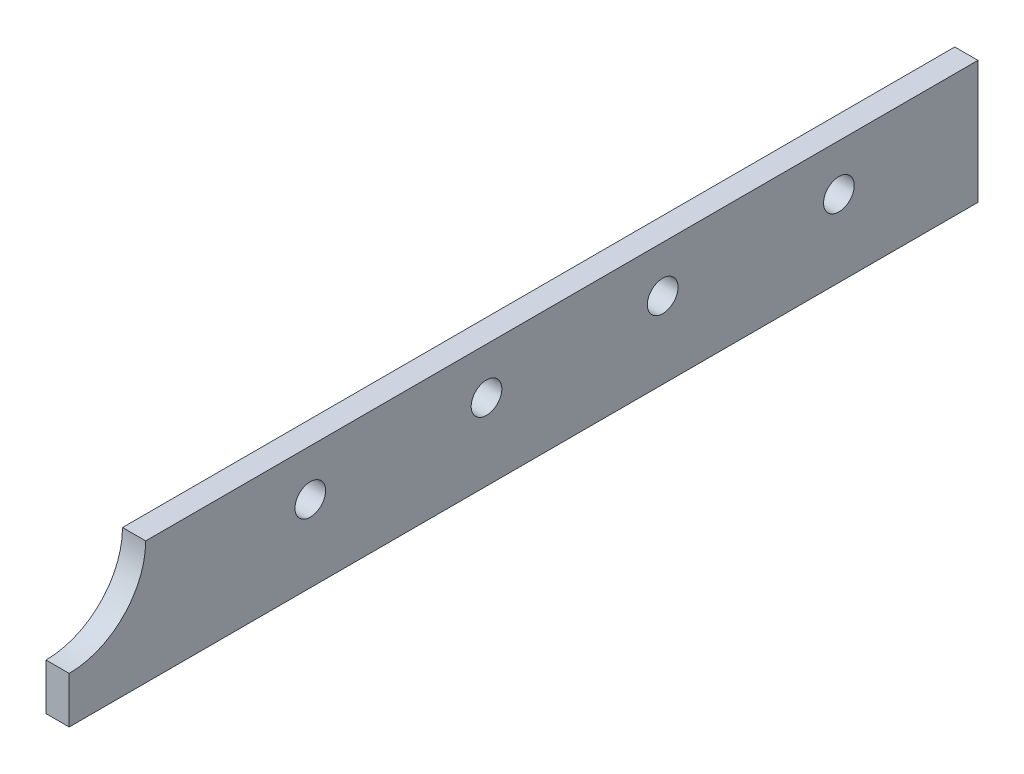
ISO-10303-21;
HEADER;
FILE_DESCRIPTION(('STEP AP214'),'2;1');
FILE_NAME('part.step','',(''),(''),'','','');
FILE_SCHEMA(('AUTOMOTIVE_DESIGN { 1 0 10303 214 1 1 1 1 }'));
ENDSEC;
DATA;
#1=APPLICATION_CONTEXT('core data for automotive mechanical design processes');
#2=APPLICATION_PROTOCOL_DEFINITION('international standard','automotive_design',2000,#1);
#3=PRODUCT_CONTEXT('',#1,'mechanical');
#4=PRODUCT('Part','Part','',(#3));
#5=PRODUCT_RELATED_PRODUCT_CATEGORY('part','',(#4));
#6=PRODUCT_DEFINITION_FORMATION('','',#4);
#7=PRODUCT_DEFINITION_CONTEXT('part definition',#1,'design');
#8=PRODUCT_DEFINITION('design','',#6,#7);
#9=PRODUCT_DEFINITION_SHAPE('','',#8);
#10=(LENGTH_UNIT() NAMED_UNIT(*) SI_UNIT(.MILLI.,.METRE.));
#11=(NAMED_UNIT(*) PLANE_ANGLE_UNIT() SI_UNIT($,.RADIAN.));
#12=(NAMED_UNIT(*) SI_UNIT($,.STERADIAN.) SOLID_ANGLE_UNIT());
#13=UNCERTAINTY_MEASURE_WITH_UNIT(LENGTH_MEASURE(1.E-05),#10,'distance_accuracy_value','');
#14=(GEOMETRIC_REPRESENTATION_CONTEXT(3) GLOBAL_UNCERTAINTY_ASSIGNED_CONTEXT((#13)) GLOBAL_UNIT_ASSIGNED_CONTEXT((#10,
#11,#12)) REPRESENTATION_CONTEXT('',''));
#15=CARTESIAN_POINT('',(0.,0.,0.));
#16=DIRECTION('',(0.,0.,1.));
#17=DIRECTION('',(1.,0.,0.));
#18=AXIS2_PLACEMENT_3D('',#15,#16,#17);
#19=CARTESIAN_POINT('',(3.175,-8.4201,-62.23));
#20=DIRECTION('',(0.,0.,1.));
#21=DIRECTION('',(1.,0.,0.));
#22=AXIS2_PLACEMENT_3D('',#19,#20,#21);
#23=PLANE('',#22);
#24=DIRECTION('',(0.,1.,0.));
#25=VECTOR('',#24,1.);
#26=CARTESIAN_POINT('',(0.,-8.4201,-62.23));
#27=LINE('',#26,#25);
#28=CARTESIAN_POINT('',(0.,-8.4201,-62.23));
#29=VERTEX_POINT('',#28);
#30=CARTESIAN_POINT('',(0.,8.4201,-62.23));
#31=VERTEX_POINT('',#30);
#32=EDGE_CURVE('E113',#29,#31,#27,.T.);
#33=ORIENTED_EDGE('',*,*,#32,.T.);
#34=DIRECTION('',(-1.,0.,0.));
#35=VECTOR('',#34,1.);
#36=CARTESIAN_POINT('',(3.175,8.4201,-62.23));
#37=LINE('',#36,#35);
#38=CARTESIAN_POINT('',(3.175,8.4201,-62.23));
#39=VERTEX_POINT('',#38);
#40=EDGE_CURVE('E11',#39,#31,#37,.T.);
#41=ORIENTED_EDGE('',*,*,#40,.F.);
#42=DIRECTION('',(0.,1.,0.));
#43=VECTOR('',#42,1.);
#44=CARTESIAN_POINT('',(3.175,-8.4201,-62.23));
#45=LINE('',#44,#43);
#46=CARTESIAN_POINT('',(3.175,-8.4201,-62.23));
#47=VERTEX_POINT('',#46);
#48=EDGE_CURVE('E122',#47,#39,#45,.T.);
#49=ORIENTED_EDGE('',*,*,#48,.F.);
#50=DIRECTION('',(-1.,0.,0.));
#51=VECTOR('',#50,1.);
#52=CARTESIAN_POINT('',(3.175,-8.4201,-62.23));
#53=LINE('',#52,#51);
#54=EDGE_CURVE('E109',#47,#29,#53,.T.);
#55=ORIENTED_EDGE('',*,*,#54,.T.);
#56=EDGE_LOOP('',(#33,#41,#49,#55));
#57=FACE_BOUND('',#56,.T.);
#58=ADVANCED_FACE('F39',(#57),#23,.F.);
#59=CARTESIAN_POINT('',(3.175,8.4201,51.7525));
#60=DIRECTION('',(0.,-1.,0.));
#61=DIRECTION('',(0.,0.,-1.));
#62=AXIS2_PLACEMENT_3D('',#59,#60,#61);
#63=PLANE('',#62);
#64=DIRECTION('',(0.,0.,1.));
#65=VECTOR('',#64,1.);
#66=CARTESIAN_POINT('',(0.,8.4201,51.7525));
#67=LINE('',#66,#65);
#68=CARTESIAN_POINT('',(0.,8.4201,51.7525));
#69=VERTEX_POINT('',#68);
#70=EDGE_CURVE('E116',#31,#69,#67,.T.);
#71=ORIENTED_EDGE('',*,*,#70,.T.);
#72=DIRECTION('',(-1.,0.,0.));
#73=VECTOR('',#72,1.);
#74=CARTESIAN_POINT('',(3.175,8.4201,51.7525));
#75=LINE('',#74,#73);
#76=CARTESIAN_POINT('',(3.175,8.4201,51.7525));
#77=VERTEX_POINT('',#76);
#78=EDGE_CURVE('E47',#77,#69,#75,.T.);
#79=ORIENTED_EDGE('',*,*,#78,.F.);
#80=DIRECTION('',(0.,0.,1.));
#81=VECTOR('',#80,1.);
#82=CARTESIAN_POINT('',(3.175,8.4201,51.7525));
#83=LINE('',#82,#81);
#84=EDGE_CURVE('E89',#39,#77,#83,.T.);
#85=ORIENTED_EDGE('',*,*,#84,.F.);
#86=ORIENTED_EDGE('',*,*,#40,.T.);
#87=EDGE_LOOP('',(#71,#79,#85,#86));
#88=FACE_BOUND('',#87,.T.);
#89=ADVANCED_FACE('F142',(#88),#63,.F.);
#90=CARTESIAN_POINT('',(3.175,8.4201,62.23));
#91=DIRECTION('',(-1.,0.,0.));
#92=DIRECTION('',(0.,0.,1.));
#93=AXIS2_PLACEMENT_3D('',#90,#91,#92);
#94=CYLINDRICAL_SURFACE('',#93,10.4775);
#95=CARTESIAN_POINT('',(0.,8.4201,62.23));
#96=DIRECTION('',(-1.,0.,0.));
#97=DIRECTION('',(0.,0.,-1.));
#98=AXIS2_PLACEMENT_3D('',#95,#96,#97);
#99=CIRCLE('',#98,10.4775);
#100=CARTESIAN_POINT('',(0.,-2.05739999999999,62.23));
#101=VERTEX_POINT('',#100);
#102=EDGE_CURVE('E104',#69,#101,#99,.T.);
#103=ORIENTED_EDGE('',*,*,#102,.T.);
#104=DIRECTION('',(-1.,0.,0.));
#105=VECTOR('',#104,1.);
#106=CARTESIAN_POINT('',(3.175,-2.05739999999999,62.23));
#107=LINE('',#106,#105);
#108=CARTESIAN_POINT('',(3.175,-2.05739999999999,62.23));
#109=VERTEX_POINT('',#108);
#110=EDGE_CURVE('E101',#109,#101,#107,.T.);
#111=ORIENTED_EDGE('',*,*,#110,.F.);
#112=CARTESIAN_POINT('',(3.175,8.4201,62.23));
#113=DIRECTION('',(-1.,0.,0.));
#114=DIRECTION('',(0.,0.,-1.));
#115=AXIS2_PLACEMENT_3D('',#112,#113,#114);
#116=CIRCLE('',#115,10.4775);
#117=EDGE_CURVE('E93',#77,#109,#116,.T.);
#118=ORIENTED_EDGE('',*,*,#117,.F.);
#119=ORIENTED_EDGE('',*,*,#78,.T.);
#120=EDGE_LOOP('',(#103,#111,#118,#119));
#121=FACE_BOUND('',#120,.T.);
#122=ADVANCED_FACE('F102',(#121),#94,.F.);
#123=CARTESIAN_POINT('',(3.175,-8.4201,62.23));
#124=DIRECTION('',(0.,0.,-1.));
#125=DIRECTION('',(0.,1.,0.));
#126=AXIS2_PLACEMENT_3D('',#123,#124,#125);
#127=PLANE('',#126);
#128=DIRECTION('',(0.,-1.,0.));
#129=VECTOR('',#128,1.);
#130=CARTESIAN_POINT('',(0.,-8.4201,62.23));
#131=LINE('',#130,#129);
#132=CARTESIAN_POINT('',(0.,-8.4201,62.23));
#133=VERTEX_POINT('',#132);
#134=EDGE_CURVE('E75',#101,#133,#131,.T.);
#135=ORIENTED_EDGE('',*,*,#134,.T.);
#136=DIRECTION('',(-1.,0.,0.));
#137=VECTOR('',#136,1.);
#138=CARTESIAN_POINT('',(3.175,-8.4201,62.23));
#139=LINE('',#138,#137);
#140=CARTESIAN_POINT('',(3.175,-8.4201,62.23));
#141=VERTEX_POINT('',#140);
#142=EDGE_CURVE('E105',#141,#133,#139,.T.);
#143=ORIENTED_EDGE('',*,*,#142,.F.);
#144=DIRECTION('',(0.,-1.,0.));
#145=VECTOR('',#144,1.);
#146=CARTESIAN_POINT('',(3.175,-8.4201,62.23));
#147=LINE('',#146,#145);
#148=EDGE_CURVE('E97',#109,#141,#147,.T.);
#149=ORIENTED_EDGE('',*,*,#148,.F.);
#150=ORIENTED_EDGE('',*,*,#110,.T.);
#151=EDGE_LOOP('',(#135,#143,#149,#150));
#152=FACE_BOUND('',#151,.T.);
#153=ADVANCED_FACE('F107',(#152),#127,.F.);
#154=CARTESIAN_POINT('',(3.175,-8.4201,62.23));
#155=DIRECTION('',(0.,1.,0.));
#156=DIRECTION('',(0.,0.,1.));
#157=AXIS2_PLACEMENT_3D('',#154,#155,#156);
#158=PLANE('',#157);
#159=DIRECTION('',(0.,0.,-1.));
#160=VECTOR('',#159,1.);
#161=CARTESIAN_POINT('',(0.,-8.4201,62.23));
#162=LINE('',#161,#160);
#163=EDGE_CURVE('E81',#133,#29,#162,.T.);
#164=ORIENTED_EDGE('',*,*,#163,.T.);
#165=ORIENTED_EDGE('',*,*,#54,.F.);
#166=DIRECTION('',(0.,0.,-1.));
#167=VECTOR('',#166,1.);
#168=CARTESIAN_POINT('',(3.175,-8.4201,62.23));
#169=LINE('',#168,#167);
#170=EDGE_CURVE('E55',#141,#47,#169,.T.);
#171=ORIENTED_EDGE('',*,*,#170,.F.);
#172=ORIENTED_EDGE('',*,*,#142,.T.);
#173=EDGE_LOOP('',(#164,#165,#171,#172));
#174=FACE_BOUND('',#173,.T.);
#175=ADVANCED_FACE('F130',(#174),#158,.F.);
#176=CARTESIAN_POINT('',(3.175,8.4201,62.23));
#177=DIRECTION('',(1.,0.,0.));
#178=DIRECTION('',(0.,0.,-1.));
#179=AXIS2_PLACEMENT_3D('',#176,#177,#178);
#180=PLANE('',#179);
#181=CARTESIAN_POINT('',(3.175,2.0701,-43.18));
#182=DIRECTION('',(-1.,0.,0.));
#183=DIRECTION('',(0.,0.,1.));
#184=AXIS2_PLACEMENT_3D('',#181,#182,#183);
#185=CIRCLE('',#184,2.1);
#186=CARTESIAN_POINT('',(3.175,2.0701,-41.08));
#187=VERTEX_POINT('',#186);
#188=EDGE_CURVE('E117',#187,#187,#185,.T.);
#189=ORIENTED_EDGE('',*,*,#188,.T.);
#190=EDGE_LOOP('',(#189));
#191=FACE_BOUND('',#190,.T.);
#192=CARTESIAN_POINT('',(3.175,2.0701,-19.05));
#193=DIRECTION('',(-1.,0.,0.));
#194=DIRECTION('',(0.,0.,1.));
#195=AXIS2_PLACEMENT_3D('',#192,#193,#194);
#196=CIRCLE('',#195,2.1);
#197=CARTESIAN_POINT('',(3.175,2.0701,-16.95));
#198=VERTEX_POINT('',#197);
#199=EDGE_CURVE('E229',#198,#198,#196,.T.);
#200=ORIENTED_EDGE('',*,*,#199,.T.);
#201=EDGE_LOOP('',(#200));
#202=FACE_BOUND('',#201,.T.);
#203=CARTESIAN_POINT('',(3.175,2.0701,5.08000000000002));
#204=DIRECTION('',(-1.,0.,0.));
#205=DIRECTION('',(0.,0.,1.));
#206=AXIS2_PLACEMENT_3D('',#203,#204,#205);
#207=CIRCLE('',#206,2.1);
#208=CARTESIAN_POINT('',(3.175,2.0701,7.18000000000002));
#209=VERTEX_POINT('',#208);
#210=EDGE_CURVE('E237',#209,#209,#207,.T.);
#211=ORIENTED_EDGE('',*,*,#210,.T.);
#212=EDGE_LOOP('',(#211));
#213=FACE_BOUND('',#212,.T.);
#214=CARTESIAN_POINT('',(3.175,2.0701,29.21));
#215=DIRECTION('',(-1.,0.,0.));
#216=DIRECTION('',(0.,0.,1.));
#217=AXIS2_PLACEMENT_3D('',#214,#215,#216);
#218=CIRCLE('',#217,2.1);
#219=CARTESIAN_POINT('',(3.175,2.0701,31.31));
#220=VERTEX_POINT('',#219);
#221=EDGE_CURVE('E243',#220,#220,#218,.T.);
#222=ORIENTED_EDGE('',*,*,#221,.T.);
#223=EDGE_LOOP('',(#222));
#224=FACE_BOUND('',#223,.T.);
#225=ORIENTED_EDGE('',*,*,#48,.T.);
#226=ORIENTED_EDGE('',*,*,#84,.T.);
#227=ORIENTED_EDGE('',*,*,#117,.T.);
#228=ORIENTED_EDGE('',*,*,#148,.T.);
#229=ORIENTED_EDGE('',*,*,#170,.T.);
#230=EDGE_LOOP('',(#225,#226,#227,#228,#229));
#231=FACE_BOUND('',#230,.T.);
#232=ADVANCED_FACE('F95',(#191,#202,#213,#224,#231),#180,.T.);
#233=CARTESIAN_POINT('',(0.,8.4201,62.23));
#234=DIRECTION('',(1.,0.,0.));
#235=DIRECTION('',(0.,0.,-1.));
#236=AXIS2_PLACEMENT_3D('',#233,#234,#235);
#237=PLANE('',#236);
#238=CARTESIAN_POINT('',(0.,2.0701,-43.18));
#239=DIRECTION('',(-1.,0.,0.));
#240=DIRECTION('',(0.,0.,1.));
#241=AXIS2_PLACEMENT_3D('',#238,#239,#240);
#242=CIRCLE('',#241,2.1);
#243=CARTESIAN_POINT('',(0.,2.0701,-41.08));
#244=VERTEX_POINT('',#243);
#245=EDGE_CURVE('E224',#244,#244,#242,.T.);
#246=ORIENTED_EDGE('',*,*,#245,.F.);
#247=EDGE_LOOP('',(#246));
#248=FACE_BOUND('',#247,.T.);
#249=CARTESIAN_POINT('',(0.,2.0701,-19.05));
#250=DIRECTION('',(-1.,0.,0.));
#251=DIRECTION('',(0.,0.,1.));
#252=AXIS2_PLACEMENT_3D('',#249,#250,#251);
#253=CIRCLE('',#252,2.1);
#254=CARTESIAN_POINT('',(0.,2.0701,-16.95));
#255=VERTEX_POINT('',#254);
#256=EDGE_CURVE('E225',#255,#255,#253,.T.);
#257=ORIENTED_EDGE('',*,*,#256,.F.);
#258=EDGE_LOOP('',(#257));
#259=FACE_BOUND('',#258,.T.);
#260=CARTESIAN_POINT('',(0.,2.0701,5.08000000000002));
#261=DIRECTION('',(-1.,0.,0.));
#262=DIRECTION('',(0.,0.,1.));
#263=AXIS2_PLACEMENT_3D('',#260,#261,#262);
#264=CIRCLE('',#263,2.1);
#265=CARTESIAN_POINT('',(0.,2.0701,7.18000000000002));
#266=VERTEX_POINT('',#265);
#267=EDGE_CURVE('E234',#266,#266,#264,.T.);
#268=ORIENTED_EDGE('',*,*,#267,.F.);
#269=EDGE_LOOP('',(#268));
#270=FACE_BOUND('',#269,.T.);
#271=CARTESIAN_POINT('',(0.,2.0701,29.21));
#272=DIRECTION('',(-1.,0.,0.));
#273=DIRECTION('',(0.,0.,1.));
#274=AXIS2_PLACEMENT_3D('',#271,#272,#273);
#275=CIRCLE('',#274,2.1);
#276=CARTESIAN_POINT('',(0.,2.0701,31.31));
#277=VERTEX_POINT('',#276);
#278=EDGE_CURVE('E240',#277,#277,#275,.T.);
#279=ORIENTED_EDGE('',*,*,#278,.F.);
#280=EDGE_LOOP('',(#279));
#281=FACE_BOUND('',#280,.T.);
#282=ORIENTED_EDGE('',*,*,#32,.F.);
#283=ORIENTED_EDGE('',*,*,#163,.F.);
#284=ORIENTED_EDGE('',*,*,#134,.F.);
#285=ORIENTED_EDGE('',*,*,#102,.F.);
#286=ORIENTED_EDGE('',*,*,#70,.F.);
#287=EDGE_LOOP('',(#282,#283,#284,#285,#286));
#288=FACE_BOUND('',#287,.T.);
#289=ADVANCED_FACE('F126',(#248,#259,#270,#281,#288),#237,.F.);
#290=CARTESIAN_POINT('',(3.175,2.0701,29.21));
#291=DIRECTION('',(-1.,0.,0.));
#292=DIRECTION('',(0.,0.,1.));
#293=AXIS2_PLACEMENT_3D('',#290,#291,#292);
#294=CYLINDRICAL_SURFACE('',#293,2.1);
#295=ORIENTED_EDGE('',*,*,#221,.F.);
#296=EDGE_LOOP('',(#295));
#297=FACE_BOUND('',#296,.T.);
#298=ORIENTED_EDGE('',*,*,#278,.T.);
#299=EDGE_LOOP('',(#298));
#300=FACE_BOUND('',#299,.T.);
#301=ADVANCED_FACE('F177',(#297,#300),#294,.F.);
#302=CARTESIAN_POINT('',(3.175,2.0701,5.08000000000002));
#303=DIRECTION('',(-1.,0.,0.));
#304=DIRECTION('',(0.,0.,1.));
#305=AXIS2_PLACEMENT_3D('',#302,#303,#304);
#306=CYLINDRICAL_SURFACE('',#305,2.1);
#307=ORIENTED_EDGE('',*,*,#210,.F.);
#308=EDGE_LOOP('',(#307));
#309=FACE_BOUND('',#308,.T.);
#310=ORIENTED_EDGE('',*,*,#267,.T.);
#311=EDGE_LOOP('',(#310));
#312=FACE_BOUND('',#311,.T.);
#313=ADVANCED_FACE('F186',(#309,#312),#306,.F.);
#314=CARTESIAN_POINT('',(3.175,2.0701,-19.05));
#315=DIRECTION('',(-1.,0.,0.));
#316=DIRECTION('',(0.,0.,1.));
#317=AXIS2_PLACEMENT_3D('',#314,#315,#316);
#318=CYLINDRICAL_SURFACE('',#317,2.1);
#319=ORIENTED_EDGE('',*,*,#199,.F.);
#320=EDGE_LOOP('',(#319));
#321=FACE_BOUND('',#320,.T.);
#322=ORIENTED_EDGE('',*,*,#256,.T.);
#323=EDGE_LOOP('',(#322));
#324=FACE_BOUND('',#323,.T.);
#325=ADVANCED_FACE('F196',(#321,#324),#318,.F.);
#326=CARTESIAN_POINT('',(3.175,2.0701,-43.18));
#327=DIRECTION('',(-1.,0.,0.));
#328=DIRECTION('',(0.,0.,1.));
#329=AXIS2_PLACEMENT_3D('',#326,#327,#328);
#330=CYLINDRICAL_SURFACE('',#329,2.1);
#331=ORIENTED_EDGE('',*,*,#188,.F.);
#332=EDGE_LOOP('',(#331));
#333=FACE_BOUND('',#332,.T.);
#334=ORIENTED_EDGE('',*,*,#245,.T.);
#335=EDGE_LOOP('',(#334));
#336=FACE_BOUND('',#335,.T.);
#337=ADVANCED_FACE('F206',(#333,#336),#330,.F.);
#338=CLOSED_SHELL('',(#58,#89,#122,#153,#175,#232,#289,#301,#313,#325,#337));
#339=MANIFOLD_SOLID_BREP('B2',#338);
#340=ADVANCED_BREP_SHAPE_REPRESENTATION('',(#18,#339),#14);
#341=SHAPE_DEFINITION_REPRESENTATION(#9,#340);
ENDSEC;
END-ISO-10303-21;
